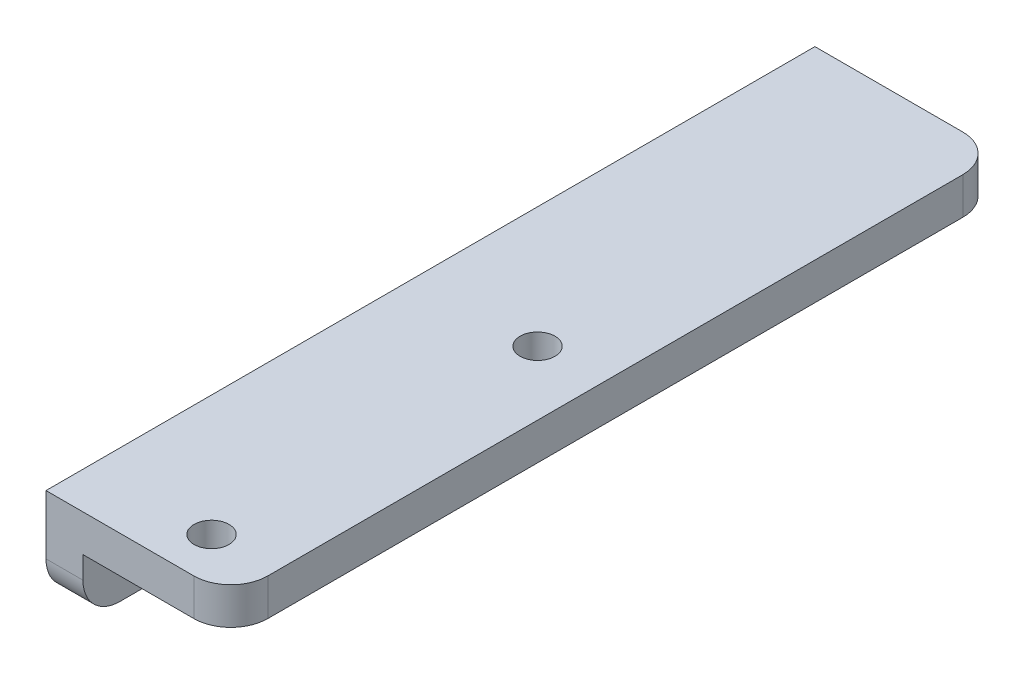
ISO-10303-21;
HEADER;
FILE_DESCRIPTION(('STEP AP214'),'2;1');
FILE_NAME('part.step','',(''),(''),'','','');
FILE_SCHEMA(('AUTOMOTIVE_DESIGN { 1 0 10303 214 1 1 1 1 }'));
ENDSEC;
DATA;
#1=APPLICATION_CONTEXT('core data for automotive mechanical design processes');
#2=APPLICATION_PROTOCOL_DEFINITION('international standard','automotive_design',2000,#1);
#3=PRODUCT_CONTEXT('',#1,'mechanical');
#4=PRODUCT('Part','Part','',(#3));
#5=PRODUCT_RELATED_PRODUCT_CATEGORY('part','',(#4));
#6=PRODUCT_DEFINITION_FORMATION('','',#4);
#7=PRODUCT_DEFINITION_CONTEXT('part definition',#1,'design');
#8=PRODUCT_DEFINITION('design','',#6,#7);
#9=PRODUCT_DEFINITION_SHAPE('','',#8);
#10=(LENGTH_UNIT() NAMED_UNIT(*) SI_UNIT(.MILLI.,.METRE.));
#11=(NAMED_UNIT(*) PLANE_ANGLE_UNIT() SI_UNIT($,.RADIAN.));
#12=(NAMED_UNIT(*) SI_UNIT($,.STERADIAN.) SOLID_ANGLE_UNIT());
#13=UNCERTAINTY_MEASURE_WITH_UNIT(LENGTH_MEASURE(1.E-05),#10,'distance_accuracy_value','');
#14=(GEOMETRIC_REPRESENTATION_CONTEXT(3) GLOBAL_UNCERTAINTY_ASSIGNED_CONTEXT((#13)) GLOBAL_UNIT_ASSIGNED_CONTEXT((#10,
#11,#12)) REPRESENTATION_CONTEXT('',''));
#15=CARTESIAN_POINT('',(0.,0.,0.));
#16=DIRECTION('',(0.,0.,1.));
#17=DIRECTION('',(1.,0.,0.));
#18=AXIS2_PLACEMENT_3D('',#15,#16,#17);
#19=CARTESIAN_POINT('',(0.,-15.875,66.04));
#20=DIRECTION('',(0.,-1.,0.));
#21=DIRECTION('',(0.,0.,1.));
#22=AXIS2_PLACEMENT_3D('',#19,#20,#21);
#23=PLANE('',#22);
#24=DIRECTION('',(0.,0.,-1.));
#25=VECTOR('',#24,1.);
#26=CARTESIAN_POINT('',(3.175,-15.875,66.04));
#27=LINE('',#26,#25);
#28=CARTESIAN_POINT('',(3.175,-15.875,17.145));
#29=VERTEX_POINT('',#28);
#30=CARTESIAN_POINT('',(3.175,-15.875,3.175));
#31=VERTEX_POINT('',#30);
#32=EDGE_CURVE('E254',#29,#31,#27,.T.);
#33=ORIENTED_EDGE('',*,*,#32,.F.);
#34=DIRECTION('',(0.,0.,1.));
#35=VECTOR('',#34,1.);
#36=CARTESIAN_POINT('',(3.175,-15.875,17.145));
#37=LINE('',#36,#35);
#38=CARTESIAN_POINT('',(3.175,-15.875,22.225));
#39=VERTEX_POINT('',#38);
#40=EDGE_CURVE('E199',#29,#39,#37,.T.);
#41=ORIENTED_EDGE('',*,*,#40,.T.);
#42=CARTESIAN_POINT('',(3.175,-15.875,37.465));
#43=VERTEX_POINT('',#42);
#44=EDGE_CURVE('E251',#43,#39,#27,.T.);
#45=ORIENTED_EDGE('',*,*,#44,.F.);
#46=DIRECTION('',(-1.,0.,0.));
#47=VECTOR('',#46,1.);
#48=CARTESIAN_POINT('',(0.,-15.875,37.465));
#49=LINE('',#48,#47);
#50=CARTESIAN_POINT('',(0.,-15.875,37.465));
#51=VERTEX_POINT('',#50);
#52=EDGE_CURVE('E288',#51,#43,#49,.F.);
#53=ORIENTED_EDGE('',*,*,#52,.F.);
#54=DIRECTION('',(0.,0.,-1.));
#55=VECTOR('',#54,1.);
#56=CARTESIAN_POINT('',(0.,-15.875,66.04));
#57=LINE('',#56,#55);
#58=CARTESIAN_POINT('',(0.,-15.875,3.175));
#59=VERTEX_POINT('',#58);
#60=EDGE_CURVE('E255',#51,#59,#57,.T.);
#61=ORIENTED_EDGE('',*,*,#60,.T.);
#62=DIRECTION('',(1.,0.,0.));
#63=VECTOR('',#62,1.);
#64=CARTESIAN_POINT('',(0.,-15.875,3.175));
#65=LINE('',#64,#63);
#66=EDGE_CURVE('E291',#31,#59,#65,.F.);
#67=ORIENTED_EDGE('',*,*,#66,.F.);
#68=EDGE_LOOP('',(#33,#41,#45,#53,#61,#67));
#69=FACE_BOUND('',#68,.T.);
#70=ADVANCED_FACE('F45',(#69),#23,.T.);
#71=CARTESIAN_POINT('',(0.,-3.175,66.04));
#72=DIRECTION('',(0.,-1.,0.));
#73=DIRECTION('',(0.,0.,1.));
#74=AXIS2_PLACEMENT_3D('',#71,#72,#73);
#75=PLANE('',#74);
#76=DIRECTION('',(0.,0.,-1.));
#77=VECTOR('',#76,1.);
#78=CARTESIAN_POINT('',(15.875,-3.175,66.04));
#79=LINE('',#78,#77);
#80=CARTESIAN_POINT('',(15.875,-3.175,17.145));
#81=VERTEX_POINT('',#80);
#82=CARTESIAN_POINT('',(15.875,-3.175,3.175));
#83=VERTEX_POINT('',#82);
#84=EDGE_CURVE('E236',#81,#83,#79,.T.);
#85=ORIENTED_EDGE('',*,*,#84,.F.);
#86=DIRECTION('',(-1.,0.,0.));
#87=VECTOR('',#86,1.);
#88=CARTESIAN_POINT('',(3.175,-3.175,17.145));
#89=LINE('',#88,#87);
#90=CARTESIAN_POINT('',(3.175,-3.175,17.145));
#91=VERTEX_POINT('',#90);
#92=EDGE_CURVE('E192',#81,#91,#89,.T.);
#93=ORIENTED_EDGE('',*,*,#92,.T.);
#94=DIRECTION('',(0.,0.,-1.));
#95=VECTOR('',#94,1.);
#96=CARTESIAN_POINT('',(3.175,-3.175,66.04));
#97=LINE('',#96,#95);
#98=CARTESIAN_POINT('',(3.175,-3.175,0.));
#99=VERTEX_POINT('',#98);
#100=EDGE_CURVE('E250',#91,#99,#97,.T.);
#101=ORIENTED_EDGE('',*,*,#100,.T.);
#102=DIRECTION('',(1.,0.,0.));
#103=VECTOR('',#102,1.);
#104=CARTESIAN_POINT('',(0.,-3.175,0.));
#105=LINE('',#104,#103);
#106=CARTESIAN_POINT('',(12.7,-3.175,0.));
#107=VERTEX_POINT('',#106);
#108=EDGE_CURVE('E215',#99,#107,#105,.T.);
#109=ORIENTED_EDGE('',*,*,#108,.T.);
#110=CARTESIAN_POINT('',(12.7,-3.175,3.175));
#111=DIRECTION('',(0.,1.,0.));
#112=DIRECTION('',(0.,0.,1.));
#113=AXIS2_PLACEMENT_3D('',#110,#111,#112);
#114=CIRCLE('',#113,3.175);
#115=EDGE_CURVE('E283',#83,#107,#114,.T.);
#116=ORIENTED_EDGE('',*,*,#115,.F.);
#117=EDGE_LOOP('',(#85,#93,#101,#109,#116));
#118=FACE_BOUND('',#117,.T.);
#119=ADVANCED_FACE('F363',(#118),#75,.T.);
#120=CARTESIAN_POINT('',(3.175,0.,66.04));
#121=DIRECTION('',(1.,0.,0.));
#122=DIRECTION('',(0.,0.,1.));
#123=AXIS2_PLACEMENT_3D('',#120,#121,#122);
#124=PLANE('',#123);
#125=CARTESIAN_POINT('',(3.175,-9.525,9.94999999999847));
#126=DIRECTION('',(-1.,0.,0.));
#127=DIRECTION('',(0.,0.,1.));
#128=AXIS2_PLACEMENT_3D('',#125,#126,#127);
#129=CIRCLE('',#128,2.49999999987849);
#130=CARTESIAN_POINT('',(3.175,-9.525,12.449999999877));
#131=VERTEX_POINT('',#130);
#132=EDGE_CURVE('E219',#131,#131,#129,.T.);
#133=ORIENTED_EDGE('',*,*,#132,.T.);
#134=EDGE_LOOP('',(#133));
#135=FACE_BOUND('',#134,.T.);
#136=DIRECTION('',(0.,1.,0.));
#137=VECTOR('',#136,1.);
#138=CARTESIAN_POINT('',(3.175,0.,0.));
#139=LINE('',#138,#137);
#140=CARTESIAN_POINT('',(3.175,-12.7,0.));
#141=VERTEX_POINT('',#140);
#142=EDGE_CURVE('E228',#141,#99,#139,.T.);
#143=ORIENTED_EDGE('',*,*,#142,.T.);
#144=ORIENTED_EDGE('',*,*,#100,.F.);
#145=DIRECTION('',(0.,-1.,0.));
#146=VECTOR('',#145,1.);
#147=CARTESIAN_POINT('',(3.175,-15.875,17.145));
#148=LINE('',#147,#146);
#149=EDGE_CURVE('E196',#91,#29,#148,.T.);
#150=ORIENTED_EDGE('',*,*,#149,.T.);
#151=ORIENTED_EDGE('',*,*,#32,.T.);
#152=CARTESIAN_POINT('',(3.175,-12.7,3.175));
#153=DIRECTION('',(-1.,0.,0.));
#154=DIRECTION('',(0.,0.,1.));
#155=AXIS2_PLACEMENT_3D('',#152,#153,#154);
#156=CIRCLE('',#155,3.175);
#157=EDGE_CURVE('E286',#141,#31,#156,.T.);
#158=ORIENTED_EDGE('',*,*,#157,.F.);
#159=EDGE_LOOP('',(#143,#144,#150,#151,#158));
#160=FACE_BOUND('',#159,.T.);
#161=ADVANCED_FACE('F366',(#135,#160),#124,.T.);
#162=CARTESIAN_POINT('',(10.375,-3.175,34.1966885776124));
#163=DIRECTION('',(0.,1.,0.));
#164=DIRECTION('',(0.,0.,1.));
#165=AXIS2_PLACEMENT_3D('',#162,#163,#164);
#166=CIRCLE('',#165,1.5);
#167=CARTESIAN_POINT('',(10.375,-3.175,35.6966885776124));
#168=VERTEX_POINT('',#167);
#169=EDGE_CURVE('E268',#168,#168,#166,.T.);
#170=ORIENTED_EDGE('',*,*,#169,.T.);
#171=EDGE_LOOP('',(#170));
#172=FACE_BOUND('',#171,.T.);
#173=CARTESIAN_POINT('',(10.375,-3.175,62.1966885776124));
#174=DIRECTION('',(0.,1.,0.));
#175=DIRECTION('',(0.,0.,1.));
#176=AXIS2_PLACEMENT_3D('',#173,#174,#175);
#177=CIRCLE('',#176,1.5);
#178=CARTESIAN_POINT('',(10.375,-3.175,63.6966885776124));
#179=VERTEX_POINT('',#178);
#180=EDGE_CURVE('E184',#179,#179,#177,.T.);
#181=ORIENTED_EDGE('',*,*,#180,.T.);
#182=EDGE_LOOP('',(#181));
#183=FACE_BOUND('',#182,.T.);
#184=DIRECTION('',(1.,0.,0.));
#185=VECTOR('',#184,1.);
#186=CARTESIAN_POINT('',(0.,-3.175,66.04));
#187=LINE('',#186,#185);
#188=CARTESIAN_POINT('',(3.175,-3.175,66.04));
#189=VERTEX_POINT('',#188);
#190=CARTESIAN_POINT('',(12.7,-3.175,66.04));
#191=VERTEX_POINT('',#190);
#192=EDGE_CURVE('E224',#189,#191,#187,.T.);
#193=ORIENTED_EDGE('',*,*,#192,.F.);
#194=CARTESIAN_POINT('',(3.175,-3.175,22.225));
#195=VERTEX_POINT('',#194);
#196=EDGE_CURVE('E246',#189,#195,#97,.T.);
#197=ORIENTED_EDGE('',*,*,#196,.T.);
#198=DIRECTION('',(-1.,0.,0.));
#199=VECTOR('',#198,1.);
#200=CARTESIAN_POINT('',(3.175,-3.175,22.225));
#201=LINE('',#200,#199);
#202=CARTESIAN_POINT('',(15.875,-3.175,22.225));
#203=VERTEX_POINT('',#202);
#204=EDGE_CURVE('E201',#203,#195,#201,.T.);
#205=ORIENTED_EDGE('',*,*,#204,.F.);
#206=CARTESIAN_POINT('',(15.875,-3.175,62.865));
#207=VERTEX_POINT('',#206);
#208=EDGE_CURVE('E264',#207,#203,#79,.T.);
#209=ORIENTED_EDGE('',*,*,#208,.F.);
#210=CARTESIAN_POINT('',(12.7,-3.175,62.865));
#211=DIRECTION('',(0.,1.,0.));
#212=DIRECTION('',(0.,0.,1.));
#213=AXIS2_PLACEMENT_3D('',#210,#211,#212);
#214=CIRCLE('',#213,3.175);
#215=EDGE_CURVE('E304',#191,#207,#214,.T.);
#216=ORIENTED_EDGE('',*,*,#215,.F.);
#217=EDGE_LOOP('',(#193,#197,#205,#209,#216));
#218=FACE_BOUND('',#217,.T.);
#219=ADVANCED_FACE('F348',(#172,#183,#218),#75,.T.);
#220=DIRECTION('',(0.,0.,1.));
#221=VECTOR('',#220,1.);
#222=CARTESIAN_POINT('',(3.175,-8.255,40.64));
#223=LINE('',#222,#221);
#224=CARTESIAN_POINT('',(3.175,-8.255,40.64));
#225=VERTEX_POINT('',#224);
#226=CARTESIAN_POINT('',(3.175,-8.255,62.865));
#227=VERTEX_POINT('',#226);
#228=EDGE_CURVE('E172',#225,#227,#223,.T.);
#229=ORIENTED_EDGE('',*,*,#228,.F.);
#230=DIRECTION('',(0.,-1.,0.));
#231=VECTOR('',#230,1.);
#232=CARTESIAN_POINT('',(3.175,-15.875,40.64));
#233=LINE('',#232,#231);
#234=CARTESIAN_POINT('',(3.175,-12.7,40.64));
#235=VERTEX_POINT('',#234);
#236=EDGE_CURVE('E162',#225,#235,#233,.T.);
#237=ORIENTED_EDGE('',*,*,#236,.T.);
#238=CARTESIAN_POINT('',(3.175,-12.7,37.465));
#239=DIRECTION('',(-1.,0.,0.));
#240=DIRECTION('',(0.,0.,1.));
#241=AXIS2_PLACEMENT_3D('',#238,#239,#240);
#242=CIRCLE('',#241,3.175);
#243=EDGE_CURVE('E308',#43,#235,#242,.T.);
#244=ORIENTED_EDGE('',*,*,#243,.F.);
#245=ORIENTED_EDGE('',*,*,#44,.T.);
#246=DIRECTION('',(0.,-1.,0.));
#247=VECTOR('',#246,1.);
#248=CARTESIAN_POINT('',(3.175,-15.875,22.225));
#249=LINE('',#248,#247);
#250=EDGE_CURVE('E193',#195,#39,#249,.T.);
#251=ORIENTED_EDGE('',*,*,#250,.F.);
#252=ORIENTED_EDGE('',*,*,#196,.F.);
#253=DIRECTION('',(0.,1.,0.));
#254=VECTOR('',#253,1.);
#255=CARTESIAN_POINT('',(3.175,0.,66.04));
#256=LINE('',#255,#254);
#257=CARTESIAN_POINT('',(3.175,-5.08,66.04));
#258=VERTEX_POINT('',#257);
#259=EDGE_CURVE('E234',#258,#189,#256,.T.);
#260=ORIENTED_EDGE('',*,*,#259,.F.);
#261=CARTESIAN_POINT('',(3.175,-5.08,62.865));
#262=DIRECTION('',(-1.,0.,0.));
#263=DIRECTION('',(0.,0.,1.));
#264=AXIS2_PLACEMENT_3D('',#261,#262,#263);
#265=CIRCLE('',#264,3.175);
#266=EDGE_CURVE('E53',#227,#258,#265,.T.);
#267=ORIENTED_EDGE('',*,*,#266,.F.);
#268=EDGE_LOOP('',(#229,#237,#244,#245,#251,#252,#260,#267));
#269=FACE_BOUND('',#268,.T.);
#270=CARTESIAN_POINT('',(3.175,-9.52499999999992,29.9499999999985));
#271=DIRECTION('',(-1.,0.,0.));
#272=DIRECTION('',(0.,0.,1.));
#273=AXIS2_PLACEMENT_3D('',#270,#271,#272);
#274=CIRCLE('',#273,2.49999999987849);
#275=CARTESIAN_POINT('',(3.175,-9.52499999999992,32.449999999877));
#276=VERTEX_POINT('',#275);
#277=EDGE_CURVE('E216',#276,#276,#274,.T.);
#278=ORIENTED_EDGE('',*,*,#277,.T.);
#279=EDGE_LOOP('',(#278));
#280=FACE_BOUND('',#279,.T.);
#281=ADVANCED_FACE('F313',(#269,#280),#124,.T.);
#282=CARTESIAN_POINT('',(0.,0.,66.04));
#283=DIRECTION('',(-1.,0.,0.));
#284=DIRECTION('',(0.,-1.,0.));
#285=AXIS2_PLACEMENT_3D('',#282,#283,#284);
#286=PLANE('',#285);
#287=ORIENTED_EDGE('',*,*,#60,.F.);
#288=CARTESIAN_POINT('',(0.,-12.7,37.465));
#289=DIRECTION('',(1.,0.,0.));
#290=DIRECTION('',(0.,-1.,0.));
#291=AXIS2_PLACEMENT_3D('',#288,#289,#290);
#292=CIRCLE('',#291,3.175);
#293=CARTESIAN_POINT('',(0.,-12.7,40.64));
#294=VERTEX_POINT('',#293);
#295=EDGE_CURVE('E177',#294,#51,#292,.T.);
#296=ORIENTED_EDGE('',*,*,#295,.F.);
#297=DIRECTION('',(0.,1.,0.));
#298=VECTOR('',#297,1.);
#299=CARTESIAN_POINT('',(0.,-15.875,40.64));
#300=LINE('',#299,#298);
#301=CARTESIAN_POINT('',(0.,-8.255,40.64));
#302=VERTEX_POINT('',#301);
#303=EDGE_CURVE('E159',#294,#302,#300,.T.);
#304=ORIENTED_EDGE('',*,*,#303,.T.);
#305=DIRECTION('',(0.,0.,1.));
#306=VECTOR('',#305,1.);
#307=CARTESIAN_POINT('',(0.,-8.255,40.64));
#308=LINE('',#307,#306);
#309=CARTESIAN_POINT('',(0.,-8.255,62.865));
#310=VERTEX_POINT('',#309);
#311=EDGE_CURVE('E168',#302,#310,#308,.T.);
#312=ORIENTED_EDGE('',*,*,#311,.T.);
#313=CARTESIAN_POINT('',(0.,-5.08,62.865));
#314=DIRECTION('',(1.,0.,0.));
#315=DIRECTION('',(0.,-1.,0.));
#316=AXIS2_PLACEMENT_3D('',#313,#314,#315);
#317=CIRCLE('',#316,3.175);
#318=CARTESIAN_POINT('',(0.,-5.08,66.04));
#319=VERTEX_POINT('',#318);
#320=EDGE_CURVE('E295',#319,#310,#317,.T.);
#321=ORIENTED_EDGE('',*,*,#320,.F.);
#322=DIRECTION('',(0.,-1.,0.));
#323=VECTOR('',#322,1.);
#324=CARTESIAN_POINT('',(0.,0.,66.04));
#325=LINE('',#324,#323);
#326=CARTESIAN_POINT('',(0.,0.,66.04));
#327=VERTEX_POINT('',#326);
#328=EDGE_CURVE('E231',#327,#319,#325,.T.);
#329=ORIENTED_EDGE('',*,*,#328,.F.);
#330=DIRECTION('',(0.,0.,-1.));
#331=VECTOR('',#330,1.);
#332=CARTESIAN_POINT('',(0.,0.,66.04));
#333=LINE('',#332,#331);
#334=CARTESIAN_POINT('',(0.,0.,0.));
#335=VERTEX_POINT('',#334);
#336=EDGE_CURVE('E258',#327,#335,#333,.T.);
#337=ORIENTED_EDGE('',*,*,#336,.T.);
#338=DIRECTION('',(0.,-1.,0.));
#339=VECTOR('',#338,1.);
#340=CARTESIAN_POINT('',(0.,0.,0.));
#341=LINE('',#340,#339);
#342=CARTESIAN_POINT('',(0.,-12.7,0.));
#343=VERTEX_POINT('',#342);
#344=EDGE_CURVE('E242',#335,#343,#341,.T.);
#345=ORIENTED_EDGE('',*,*,#344,.T.);
#346=CARTESIAN_POINT('',(0.,-12.7,3.175));
#347=DIRECTION('',(1.,0.,0.));
#348=DIRECTION('',(0.,-1.,0.));
#349=AXIS2_PLACEMENT_3D('',#346,#347,#348);
#350=CIRCLE('',#349,3.175);
#351=EDGE_CURVE('E297',#59,#343,#350,.T.);
#352=ORIENTED_EDGE('',*,*,#351,.F.);
#353=EDGE_LOOP('',(#287,#296,#304,#312,#321,#329,#337,#345,#352));
#354=FACE_BOUND('',#353,.T.);
#355=CARTESIAN_POINT('',(0.,-9.52499999999992,29.9499999999985));
#356=DIRECTION('',(-1.,0.,0.));
#357=DIRECTION('',(0.,0.,1.));
#358=AXIS2_PLACEMENT_3D('',#355,#356,#357);
#359=CIRCLE('',#358,2.49999999987849);
#360=CARTESIAN_POINT('',(0.,-9.52499999999992,32.449999999877));
#361=VERTEX_POINT('',#360);
#362=EDGE_CURVE('E212',#361,#361,#359,.T.);
#363=ORIENTED_EDGE('',*,*,#362,.F.);
#364=EDGE_LOOP('',(#363));
#365=FACE_BOUND('',#364,.T.);
#366=CARTESIAN_POINT('',(0.,-9.525,9.94999999999847));
#367=DIRECTION('',(-1.,0.,0.));
#368=DIRECTION('',(0.,0.,1.));
#369=AXIS2_PLACEMENT_3D('',#366,#367,#368);
#370=CIRCLE('',#369,2.49999999987849);
#371=CARTESIAN_POINT('',(0.,-9.525,12.449999999877));
#372=VERTEX_POINT('',#371);
#373=EDGE_CURVE('E211',#372,#372,#370,.T.);
#374=ORIENTED_EDGE('',*,*,#373,.F.);
#375=EDGE_LOOP('',(#374));
#376=FACE_BOUND('',#375,.T.);
#377=ADVANCED_FACE('F175',(#354,#365,#376),#286,.T.);
#378=CARTESIAN_POINT('',(0.,0.,66.04));
#379=DIRECTION('',(0.,-1.,0.));
#380=DIRECTION('',(0.,0.,1.));
#381=AXIS2_PLACEMENT_3D('',#378,#379,#380);
#382=PLANE('',#381);
#383=CARTESIAN_POINT('',(10.375,0.,34.1966885776124));
#384=DIRECTION('',(0.,1.,0.));
#385=DIRECTION('',(0.,0.,1.));
#386=AXIS2_PLACEMENT_3D('',#383,#384,#385);
#387=CIRCLE('',#386,1.5);
#388=CARTESIAN_POINT('',(10.375,0.,35.6966885776124));
#389=VERTEX_POINT('',#388);
#390=EDGE_CURVE('E178',#389,#389,#387,.T.);
#391=ORIENTED_EDGE('',*,*,#390,.F.);
#392=EDGE_LOOP('',(#391));
#393=FACE_BOUND('',#392,.T.);
#394=CARTESIAN_POINT('',(10.375,0.,62.1966885776124));
#395=DIRECTION('',(0.,1.,0.));
#396=DIRECTION('',(0.,0.,1.));
#397=AXIS2_PLACEMENT_3D('',#394,#395,#396);
#398=CIRCLE('',#397,1.5);
#399=CARTESIAN_POINT('',(10.375,0.,63.6966885776124));
#400=VERTEX_POINT('',#399);
#401=EDGE_CURVE('E181',#400,#400,#398,.T.);
#402=ORIENTED_EDGE('',*,*,#401,.F.);
#403=EDGE_LOOP('',(#402));
#404=FACE_BOUND('',#403,.T.);
#405=DIRECTION('',(1.,0.,0.));
#406=VECTOR('',#405,1.);
#407=CARTESIAN_POINT('',(0.,0.,0.));
#408=LINE('',#407,#406);
#409=CARTESIAN_POINT('',(12.7,0.,0.));
#410=VERTEX_POINT('',#409);
#411=EDGE_CURVE('E239',#335,#410,#408,.T.);
#412=ORIENTED_EDGE('',*,*,#411,.F.);
#413=ORIENTED_EDGE('',*,*,#336,.F.);
#414=DIRECTION('',(1.,0.,0.));
#415=VECTOR('',#414,1.);
#416=CARTESIAN_POINT('',(0.,0.,66.04));
#417=LINE('',#416,#415);
#418=CARTESIAN_POINT('',(12.7,0.,66.04));
#419=VERTEX_POINT('',#418);
#420=EDGE_CURVE('E227',#327,#419,#417,.T.);
#421=ORIENTED_EDGE('',*,*,#420,.T.);
#422=CARTESIAN_POINT('',(12.7,0.,62.865));
#423=DIRECTION('',(0.,1.,0.));
#424=DIRECTION('',(0.,0.,1.));
#425=AXIS2_PLACEMENT_3D('',#422,#423,#424);
#426=CIRCLE('',#425,3.175);
#427=CARTESIAN_POINT('',(15.875,0.,62.865));
#428=VERTEX_POINT('',#427);
#429=EDGE_CURVE('E273',#428,#419,#426,.F.);
#430=ORIENTED_EDGE('',*,*,#429,.F.);
#431=DIRECTION('',(0.,0.,-1.));
#432=VECTOR('',#431,1.);
#433=CARTESIAN_POINT('',(15.875,0.,66.04));
#434=LINE('',#433,#432);
#435=CARTESIAN_POINT('',(15.875,0.,3.175));
#436=VERTEX_POINT('',#435);
#437=EDGE_CURVE('E261',#428,#436,#434,.T.);
#438=ORIENTED_EDGE('',*,*,#437,.T.);
#439=CARTESIAN_POINT('',(12.7,0.,3.175));
#440=DIRECTION('',(0.,1.,0.));
#441=DIRECTION('',(0.,0.,1.));
#442=AXIS2_PLACEMENT_3D('',#439,#440,#441);
#443=CIRCLE('',#442,3.175);
#444=EDGE_CURVE('E276',#410,#436,#443,.F.);
#445=ORIENTED_EDGE('',*,*,#444,.F.);
#446=EDGE_LOOP('',(#412,#413,#421,#430,#438,#445));
#447=FACE_BOUND('',#446,.T.);
#448=ADVANCED_FACE('F322',(#393,#404,#447),#382,.F.);
#449=CARTESIAN_POINT('',(15.875,0.,66.04));
#450=DIRECTION('',(1.,0.,0.));
#451=DIRECTION('',(0.,0.,1.));
#452=AXIS2_PLACEMENT_3D('',#449,#450,#451);
#453=PLANE('',#452);
#454=ORIENTED_EDGE('',*,*,#437,.F.);
#455=DIRECTION('',(0.,1.,0.));
#456=VECTOR('',#455,1.);
#457=CARTESIAN_POINT('',(15.875,0.,62.865));
#458=LINE('',#457,#456);
#459=EDGE_CURVE('E279',#207,#428,#458,.T.);
#460=ORIENTED_EDGE('',*,*,#459,.F.);
#461=ORIENTED_EDGE('',*,*,#208,.T.);
#462=DIRECTION('',(0.,0.,1.));
#463=VECTOR('',#462,1.);
#464=CARTESIAN_POINT('',(15.875,-3.175,17.145));
#465=LINE('',#464,#463);
#466=EDGE_CURVE('E208',#81,#203,#465,.T.);
#467=ORIENTED_EDGE('',*,*,#466,.F.);
#468=ORIENTED_EDGE('',*,*,#84,.T.);
#469=DIRECTION('',(0.,1.,0.));
#470=VECTOR('',#469,1.);
#471=CARTESIAN_POINT('',(15.875,0.,3.175));
#472=LINE('',#471,#470);
#473=EDGE_CURVE('E281',#436,#83,#472,.F.);
#474=ORIENTED_EDGE('',*,*,#473,.F.);
#475=EDGE_LOOP('',(#454,#460,#461,#467,#468,#474));
#476=FACE_BOUND('',#475,.T.);
#477=ADVANCED_FACE('F354',(#476),#453,.T.);
#478=CARTESIAN_POINT('',(0.,0.,66.04));
#479=DIRECTION('',(0.,0.,-1.));
#480=DIRECTION('',(1.,0.,0.));
#481=AXIS2_PLACEMENT_3D('',#478,#479,#480);
#482=PLANE('',#481);
#483=ORIENTED_EDGE('',*,*,#420,.F.);
#484=ORIENTED_EDGE('',*,*,#328,.T.);
#485=DIRECTION('',(1.,0.,0.));
#486=VECTOR('',#485,1.);
#487=CARTESIAN_POINT('',(0.,-5.08,66.04));
#488=LINE('',#487,#486);
#489=EDGE_CURVE('E300',#258,#319,#488,.F.);
#490=ORIENTED_EDGE('',*,*,#489,.F.);
#491=ORIENTED_EDGE('',*,*,#259,.T.);
#492=ORIENTED_EDGE('',*,*,#192,.T.);
#493=DIRECTION('',(0.,1.,0.));
#494=VECTOR('',#493,1.);
#495=CARTESIAN_POINT('',(12.7,-3.175,66.04));
#496=LINE('',#495,#494);
#497=EDGE_CURVE('E302',#419,#191,#496,.F.);
#498=ORIENTED_EDGE('',*,*,#497,.F.);
#499=EDGE_LOOP('',(#483,#484,#490,#491,#492,#498));
#500=FACE_BOUND('',#499,.T.);
#501=ADVANCED_FACE('F317',(#500),#482,.F.);
#502=CARTESIAN_POINT('',(0.,0.,0.));
#503=DIRECTION('',(0.,0.,-1.));
#504=DIRECTION('',(1.,0.,0.));
#505=AXIS2_PLACEMENT_3D('',#502,#503,#504);
#506=PLANE('',#505);
#507=ORIENTED_EDGE('',*,*,#108,.F.);
#508=ORIENTED_EDGE('',*,*,#142,.F.);
#509=DIRECTION('',(1.,0.,0.));
#510=VECTOR('',#509,1.);
#511=CARTESIAN_POINT('',(0.,-12.7,0.));
#512=LINE('',#511,#510);
#513=EDGE_CURVE('E249',#343,#141,#512,.T.);
#514=ORIENTED_EDGE('',*,*,#513,.F.);
#515=ORIENTED_EDGE('',*,*,#344,.F.);
#516=ORIENTED_EDGE('',*,*,#411,.T.);
#517=DIRECTION('',(0.,1.,0.));
#518=VECTOR('',#517,1.);
#519=CARTESIAN_POINT('',(12.7,0.,0.));
#520=LINE('',#519,#518);
#521=EDGE_CURVE('E271',#107,#410,#520,.T.);
#522=ORIENTED_EDGE('',*,*,#521,.F.);
#523=EDGE_LOOP('',(#507,#508,#514,#515,#516,#522));
#524=FACE_BOUND('',#523,.T.);
#525=ADVANCED_FACE('F327',(#524),#506,.T.);
#526=CARTESIAN_POINT('',(0.,-9.525,9.94999999999847));
#527=DIRECTION('',(1.,0.,0.));
#528=DIRECTION('',(0.,0.,1.));
#529=AXIS2_PLACEMENT_3D('',#526,#527,#528);
#530=CYLINDRICAL_SURFACE('',#529,2.49999999987849);
#531=ORIENTED_EDGE('',*,*,#373,.T.);
#532=EDGE_LOOP('',(#531));
#533=FACE_BOUND('',#532,.T.);
#534=ORIENTED_EDGE('',*,*,#132,.F.);
#535=EDGE_LOOP('',(#534));
#536=FACE_BOUND('',#535,.T.);
#537=ADVANCED_FACE('F495',(#533,#536),#530,.F.);
#538=CARTESIAN_POINT('',(0.,-9.52499999999992,29.9499999999985));
#539=DIRECTION('',(1.,0.,0.));
#540=DIRECTION('',(0.,0.,1.));
#541=AXIS2_PLACEMENT_3D('',#538,#539,#540);
#542=CYLINDRICAL_SURFACE('',#541,2.49999999987849);
#543=ORIENTED_EDGE('',*,*,#362,.T.);
#544=EDGE_LOOP('',(#543));
#545=FACE_BOUND('',#544,.T.);
#546=ORIENTED_EDGE('',*,*,#277,.F.);
#547=EDGE_LOOP('',(#546));
#548=FACE_BOUND('',#547,.T.);
#549=ADVANCED_FACE('F376',(#545,#548),#542,.F.);
#550=CARTESIAN_POINT('',(3.175,-15.875,17.145));
#551=DIRECTION('',(-0.707106781186548,0.707106781186548,0.));
#552=DIRECTION('',(-0.707106781186548,-0.707106781186548,0.));
#553=AXIS2_PLACEMENT_3D('',#550,#551,#552);
#554=PLANE('',#553);
#555=DIRECTION('',(0.707106781186547,0.707106781186547,0.));
#556=VECTOR('',#555,1.);
#557=CARTESIAN_POINT('',(3.175,-15.875,22.225));
#558=LINE('',#557,#556);
#559=EDGE_CURVE('E188',#39,#203,#558,.T.);
#560=ORIENTED_EDGE('',*,*,#559,.F.);
#561=ORIENTED_EDGE('',*,*,#40,.F.);
#562=DIRECTION('',(0.707106781186547,0.707106781186547,0.));
#563=VECTOR('',#562,1.);
#564=CARTESIAN_POINT('',(3.175,-15.875,17.145));
#565=LINE('',#564,#563);
#566=EDGE_CURVE('E190',#29,#81,#565,.T.);
#567=ORIENTED_EDGE('',*,*,#566,.T.);
#568=ORIENTED_EDGE('',*,*,#466,.T.);
#569=EDGE_LOOP('',(#560,#561,#567,#568));
#570=FACE_BOUND('',#569,.T.);
#571=ADVANCED_FACE('F341',(#570),#554,.F.);
#572=CARTESIAN_POINT('',(0.,0.,17.145));
#573=DIRECTION('',(0.,0.,1.));
#574=DIRECTION('',(-1.,0.,0.));
#575=AXIS2_PLACEMENT_3D('',#572,#573,#574);
#576=PLANE('',#575);
#577=ORIENTED_EDGE('',*,*,#566,.F.);
#578=ORIENTED_EDGE('',*,*,#149,.F.);
#579=ORIENTED_EDGE('',*,*,#92,.F.);
#580=EDGE_LOOP('',(#577,#578,#579));
#581=FACE_BOUND('',#580,.T.);
#582=ADVANCED_FACE('F368',(#581),#576,.F.);
#583=CARTESIAN_POINT('',(0.,0.,22.225));
#584=DIRECTION('',(0.,0.,1.));
#585=DIRECTION('',(-1.,0.,0.));
#586=AXIS2_PLACEMENT_3D('',#583,#584,#585);
#587=PLANE('',#586);
#588=ORIENTED_EDGE('',*,*,#559,.T.);
#589=ORIENTED_EDGE('',*,*,#204,.T.);
#590=ORIENTED_EDGE('',*,*,#250,.T.);
#591=EDGE_LOOP('',(#588,#589,#590));
#592=FACE_BOUND('',#591,.T.);
#593=ADVANCED_FACE('F344',(#592),#587,.T.);
#594=CARTESIAN_POINT('',(0.,-8.255,40.64));
#595=DIRECTION('',(0.,1.,0.));
#596=DIRECTION('',(0.,0.,-1.));
#597=AXIS2_PLACEMENT_3D('',#594,#595,#596);
#598=PLANE('',#597);
#599=ORIENTED_EDGE('',*,*,#311,.F.);
#600=DIRECTION('',(1.,0.,0.));
#601=VECTOR('',#600,1.);
#602=CARTESIAN_POINT('',(0.,-8.255,40.64));
#603=LINE('',#602,#601);
#604=EDGE_CURVE('E155',#302,#225,#603,.T.);
#605=ORIENTED_EDGE('',*,*,#604,.T.);
#606=ORIENTED_EDGE('',*,*,#228,.T.);
#607=DIRECTION('',(1.,0.,0.));
#608=VECTOR('',#607,1.);
#609=CARTESIAN_POINT('',(0.,-8.255,62.865));
#610=LINE('',#609,#608);
#611=EDGE_CURVE('E66',#310,#227,#610,.T.);
#612=ORIENTED_EDGE('',*,*,#611,.F.);
#613=EDGE_LOOP('',(#599,#605,#606,#612));
#614=FACE_BOUND('',#613,.T.);
#615=ADVANCED_FACE('F169',(#614),#598,.F.);
#616=CARTESIAN_POINT('',(0.,0.,40.64));
#617=DIRECTION('',(0.,0.,1.));
#618=DIRECTION('',(-1.,0.,0.));
#619=AXIS2_PLACEMENT_3D('',#616,#617,#618);
#620=PLANE('',#619);
#621=ORIENTED_EDGE('',*,*,#236,.F.);
#622=ORIENTED_EDGE('',*,*,#604,.F.);
#623=ORIENTED_EDGE('',*,*,#303,.F.);
#624=DIRECTION('',(-1.,0.,0.));
#625=VECTOR('',#624,1.);
#626=CARTESIAN_POINT('',(0.,-12.7,40.64));
#627=LINE('',#626,#625);
#628=EDGE_CURVE('E11',#235,#294,#627,.T.);
#629=ORIENTED_EDGE('',*,*,#628,.F.);
#630=EDGE_LOOP('',(#621,#622,#623,#629));
#631=FACE_BOUND('',#630,.T.);
#632=ADVANCED_FACE('F157',(#631),#620,.T.);
#633=CARTESIAN_POINT('',(10.375,22.225,62.1966885776124));
#634=DIRECTION('',(0.,-1.,0.));
#635=DIRECTION('',(0.,0.,1.));
#636=AXIS2_PLACEMENT_3D('',#633,#634,#635);
#637=CYLINDRICAL_SURFACE('',#636,1.5);
#638=CARTESIAN_POINT('',(10.375,-3.175,63.6966885776124));
#639=CARTESIAN_POINT('',(10.375,-3.14192708333333,63.6966885776124));
#640=CARTESIAN_POINT('',(10.375,-3.10885416666667,63.6966885776124));
#641=CARTESIAN_POINT('',(10.375,-3.04270833333333,63.6966885776124));
#642=CARTESIAN_POINT('',(10.375,-3.00963541666667,63.6966885776124));
#643=CARTESIAN_POINT('',(10.375,-2.94348958333333,63.6966885776124));
#644=CARTESIAN_POINT('',(10.375,-2.91041666666667,63.6966885776124));
#645=CARTESIAN_POINT('',(10.375,-2.84427083333333,63.6966885776124));
#646=CARTESIAN_POINT('',(10.375,-2.81119791666667,63.6966885776124));
#647=CARTESIAN_POINT('',(10.375,-2.74505208333334,63.6966885776124));
#648=CARTESIAN_POINT('',(10.375,-2.71197916666667,63.6966885776124));
#649=CARTESIAN_POINT('',(10.375,-2.64583333333333,63.6966885776124));
#650=CARTESIAN_POINT('',(10.375,-2.61276041666667,63.6966885776124));
#651=CARTESIAN_POINT('',(10.375,-2.54661458333333,63.6966885776124));
#652=CARTESIAN_POINT('',(10.375,-2.51354166666667,63.6966885776124));
#653=CARTESIAN_POINT('',(10.375,-2.44739583333334,63.6966885776124));
#654=CARTESIAN_POINT('',(10.375,-2.41432291666667,63.6966885776124));
#655=CARTESIAN_POINT('',(10.375,-2.34817708333333,63.6966885776124));
#656=CARTESIAN_POINT('',(10.375,-2.31510416666667,63.6966885776124));
#657=CARTESIAN_POINT('',(10.375,-2.24895833333333,63.6966885776124));
#658=CARTESIAN_POINT('',(10.375,-2.21588541666667,63.6966885776124));
#659=CARTESIAN_POINT('',(10.375,-2.14973958333334,63.6966885776124));
#660=CARTESIAN_POINT('',(10.375,-2.11666666666667,63.6966885776124));
#661=CARTESIAN_POINT('',(10.375,-2.05052083333333,63.6966885776124));
#662=CARTESIAN_POINT('',(10.375,-2.01744791666667,63.6966885776124));
#663=CARTESIAN_POINT('',(10.375,-1.95130208333333,63.6966885776124));
#664=CARTESIAN_POINT('',(10.375,-1.91822916666667,63.6966885776124));
#665=CARTESIAN_POINT('',(10.375,-1.85208333333334,63.6966885776124));
#666=CARTESIAN_POINT('',(10.375,-1.81901041666667,63.6966885776124));
#667=CARTESIAN_POINT('',(10.375,-1.75286458333334,63.6966885776124));
#668=CARTESIAN_POINT('',(10.375,-1.71979166666667,63.6966885776124));
#669=CARTESIAN_POINT('',(10.375,-1.65364583333334,63.6966885776124));
#670=CARTESIAN_POINT('',(10.375,-1.62057291666667,63.6966885776124));
#671=CARTESIAN_POINT('',(10.375,-1.55442708333333,63.6966885776124));
#672=CARTESIAN_POINT('',(10.375,-1.52135416666667,63.6966885776124));
#673=CARTESIAN_POINT('',(10.375,-1.45520833333333,63.6966885776124));
#674=CARTESIAN_POINT('',(10.375,-1.42213541666667,63.6966885776124));
#675=CARTESIAN_POINT('',(10.375,-1.35598958333334,63.6966885776124));
#676=CARTESIAN_POINT('',(10.375,-1.32291666666667,63.6966885776124));
#677=CARTESIAN_POINT('',(10.375,-1.25677083333334,63.6966885776124));
#678=CARTESIAN_POINT('',(10.375,-1.22369791666667,63.6966885776124));
#679=CARTESIAN_POINT('',(10.375,-1.15755208333334,63.6966885776124));
#680=CARTESIAN_POINT('',(10.375,-1.12447916666667,63.6966885776124));
#681=CARTESIAN_POINT('',(10.375,-1.05833333333334,63.6966885776124));
#682=CARTESIAN_POINT('',(10.375,-1.02526041666667,63.6966885776124));
#683=CARTESIAN_POINT('',(10.375,-0.959114583333336,63.6966885776124));
#684=CARTESIAN_POINT('',(10.375,-0.92604166666667,63.6966885776124));
#685=CARTESIAN_POINT('',(10.375,-0.859895833333337,63.6966885776124));
#686=CARTESIAN_POINT('',(10.375,-0.82682291666667,63.6966885776124));
#687=CARTESIAN_POINT('',(10.375,-0.760677083333336,63.6966885776124));
#688=CARTESIAN_POINT('',(10.375,-0.727604166666669,63.6966885776124));
#689=CARTESIAN_POINT('',(10.375,-0.661458333333336,63.6966885776124));
#690=CARTESIAN_POINT('',(10.375,-0.62838541666667,63.6966885776124));
#691=CARTESIAN_POINT('',(10.375,-0.562239583333337,63.6966885776124));
#692=CARTESIAN_POINT('',(10.375,-0.52916666666667,63.6966885776124));
#693=CARTESIAN_POINT('',(10.375,-0.463020833333336,63.6966885776124));
#694=CARTESIAN_POINT('',(10.375,-0.429947916666668,63.6966885776124));
#695=CARTESIAN_POINT('',(10.375,-0.363802083333335,63.6966885776124));
#696=CARTESIAN_POINT('',(10.375,-0.33072916666667,63.6966885776124));
#697=CARTESIAN_POINT('',(10.375,-0.264583333333337,63.6966885776124));
#698=CARTESIAN_POINT('',(10.375,-0.231510416666669,63.6966885776124));
#699=CARTESIAN_POINT('',(10.375,-0.165364583333337,63.6966885776124));
#700=CARTESIAN_POINT('',(10.375,-0.132291666666671,63.6966885776124));
#701=CARTESIAN_POINT('',(10.375,-0.0661458333333376,63.6966885776124));
#702=CARTESIAN_POINT('',(10.375,-0.0330729166666706,63.6966885776124));
#703=CARTESIAN_POINT('',(10.375,0.,63.6966885776124));
#704=B_SPLINE_CURVE_WITH_KNOTS('',3,(#638,#639,#640,#641,#642,#643,#644,#645,#646,#647,#648,
#649,#650,#651,#652,#653,#654,#655,#656,#657,#658,#659,#660,#661,#662,#663,#664,#665,#666,#667,
#668,#669,#670,#671,#672,#673,#674,#675,#676,#677,#678,#679,#680,#681,#682,#683,#684,#685,#686,
#687,#688,#689,#690,#691,#692,#693,#694,#695,#696,#697,#698,#699,#700,#701,#702,#703),
.UNSPECIFIED.,.F.,.F.,(4,2,2,2,2,2,2,2,2,2,2,2,2,2,2,2,2,2,2,2,2,2,2,2,2,2,2,2,2,2,2,2,4),(0.,
0.0992187500000012,0.198437499999999,0.29765625,0.396874999999998,0.496093749999999,0.5953125,
0.694531249999998,0.793749999999999,0.892968750000001,0.992187499999998,1.09140625,1.190625,
1.28984375,1.3890625,1.48828125,1.5875,1.68671875,1.7859375,1.88515625,1.984375,2.08359375,
2.1828125,2.28203125,2.38125,2.48046875,2.5796875,2.67890625,2.778125,2.87734375,2.9765625,
3.07578125,3.175),.UNSPECIFIED.);
#705=EDGE_CURVE('BSEAM444',#179,#400,#704,.T.);
#706=ORIENTED_EDGE('',*,*,#180,.F.);
#707=ORIENTED_EDGE('',*,*,#401,.T.);
#708=ORIENTED_EDGE('',*,*,#705,.T.);
#709=ORIENTED_EDGE('',*,*,#705,.F.);
#710=EDGE_LOOP('',(#706,#708,#707,#709));
#711=FACE_BOUND('',#710,.T.);
#712=ADVANCED_FACE('F444',(#711),#637,.F.);
#713=CARTESIAN_POINT('',(10.375,22.225,34.1966885776124));
#714=DIRECTION('',(0.,-1.,0.));
#715=DIRECTION('',(0.,0.,1.));
#716=AXIS2_PLACEMENT_3D('',#713,#714,#715);
#717=CYLINDRICAL_SURFACE('',#716,1.5);
#718=CARTESIAN_POINT('',(10.375,-3.175,35.6966885776124));
#719=CARTESIAN_POINT('',(10.375,-3.14192708333333,35.6966885776124));
#720=CARTESIAN_POINT('',(10.375,-3.10885416666667,35.6966885776124));
#721=CARTESIAN_POINT('',(10.375,-3.04270833333333,35.6966885776124));
#722=CARTESIAN_POINT('',(10.375,-3.00963541666667,35.6966885776124));
#723=CARTESIAN_POINT('',(10.375,-2.94348958333333,35.6966885776124));
#724=CARTESIAN_POINT('',(10.375,-2.91041666666667,35.6966885776124));
#725=CARTESIAN_POINT('',(10.375,-2.84427083333333,35.6966885776124));
#726=CARTESIAN_POINT('',(10.375,-2.81119791666667,35.6966885776124));
#727=CARTESIAN_POINT('',(10.375,-2.74505208333334,35.6966885776124));
#728=CARTESIAN_POINT('',(10.375,-2.71197916666667,35.6966885776124));
#729=CARTESIAN_POINT('',(10.375,-2.64583333333333,35.6966885776124));
#730=CARTESIAN_POINT('',(10.375,-2.61276041666667,35.6966885776124));
#731=CARTESIAN_POINT('',(10.375,-2.54661458333333,35.6966885776124));
#732=CARTESIAN_POINT('',(10.375,-2.51354166666667,35.6966885776124));
#733=CARTESIAN_POINT('',(10.375,-2.44739583333334,35.6966885776124));
#734=CARTESIAN_POINT('',(10.375,-2.41432291666667,35.6966885776124));
#735=CARTESIAN_POINT('',(10.375,-2.34817708333333,35.6966885776124));
#736=CARTESIAN_POINT('',(10.375,-2.31510416666667,35.6966885776124));
#737=CARTESIAN_POINT('',(10.375,-2.24895833333333,35.6966885776124));
#738=CARTESIAN_POINT('',(10.375,-2.21588541666667,35.6966885776124));
#739=CARTESIAN_POINT('',(10.375,-2.14973958333334,35.6966885776124));
#740=CARTESIAN_POINT('',(10.375,-2.11666666666667,35.6966885776124));
#741=CARTESIAN_POINT('',(10.375,-2.05052083333333,35.6966885776124));
#742=CARTESIAN_POINT('',(10.375,-2.01744791666667,35.6966885776124));
#743=CARTESIAN_POINT('',(10.375,-1.95130208333333,35.6966885776124));
#744=CARTESIAN_POINT('',(10.375,-1.91822916666667,35.6966885776124));
#745=CARTESIAN_POINT('',(10.375,-1.85208333333334,35.6966885776124));
#746=CARTESIAN_POINT('',(10.375,-1.81901041666667,35.6966885776124));
#747=CARTESIAN_POINT('',(10.375,-1.75286458333334,35.6966885776124));
#748=CARTESIAN_POINT('',(10.375,-1.71979166666667,35.6966885776124));
#749=CARTESIAN_POINT('',(10.375,-1.65364583333334,35.6966885776124));
#750=CARTESIAN_POINT('',(10.375,-1.62057291666667,35.6966885776124));
#751=CARTESIAN_POINT('',(10.375,-1.55442708333333,35.6966885776124));
#752=CARTESIAN_POINT('',(10.375,-1.52135416666667,35.6966885776124));
#753=CARTESIAN_POINT('',(10.375,-1.45520833333333,35.6966885776124));
#754=CARTESIAN_POINT('',(10.375,-1.42213541666667,35.6966885776124));
#755=CARTESIAN_POINT('',(10.375,-1.35598958333334,35.6966885776124));
#756=CARTESIAN_POINT('',(10.375,-1.32291666666667,35.6966885776124));
#757=CARTESIAN_POINT('',(10.375,-1.25677083333334,35.6966885776124));
#758=CARTESIAN_POINT('',(10.375,-1.22369791666667,35.6966885776124));
#759=CARTESIAN_POINT('',(10.375,-1.15755208333334,35.6966885776124));
#760=CARTESIAN_POINT('',(10.375,-1.12447916666667,35.6966885776124));
#761=CARTESIAN_POINT('',(10.375,-1.05833333333334,35.6966885776124));
#762=CARTESIAN_POINT('',(10.375,-1.02526041666667,35.6966885776124));
#763=CARTESIAN_POINT('',(10.375,-0.959114583333336,35.6966885776124));
#764=CARTESIAN_POINT('',(10.375,-0.92604166666667,35.6966885776124));
#765=CARTESIAN_POINT('',(10.375,-0.859895833333337,35.6966885776124));
#766=CARTESIAN_POINT('',(10.375,-0.82682291666667,35.6966885776124));
#767=CARTESIAN_POINT('',(10.375,-0.760677083333336,35.6966885776124));
#768=CARTESIAN_POINT('',(10.375,-0.727604166666669,35.6966885776124));
#769=CARTESIAN_POINT('',(10.375,-0.661458333333336,35.6966885776124));
#770=CARTESIAN_POINT('',(10.375,-0.62838541666667,35.6966885776124));
#771=CARTESIAN_POINT('',(10.375,-0.562239583333337,35.6966885776124));
#772=CARTESIAN_POINT('',(10.375,-0.52916666666667,35.6966885776124));
#773=CARTESIAN_POINT('',(10.375,-0.463020833333336,35.6966885776124));
#774=CARTESIAN_POINT('',(10.375,-0.429947916666668,35.6966885776124));
#775=CARTESIAN_POINT('',(10.375,-0.363802083333335,35.6966885776124));
#776=CARTESIAN_POINT('',(10.375,-0.33072916666667,35.6966885776124));
#777=CARTESIAN_POINT('',(10.375,-0.264583333333337,35.6966885776124));
#778=CARTESIAN_POINT('',(10.375,-0.231510416666669,35.6966885776124));
#779=CARTESIAN_POINT('',(10.375,-0.165364583333337,35.6966885776124));
#780=CARTESIAN_POINT('',(10.375,-0.132291666666671,35.6966885776124));
#781=CARTESIAN_POINT('',(10.375,-0.0661458333333376,35.6966885776124));
#782=CARTESIAN_POINT('',(10.375,-0.0330729166666706,35.6966885776124));
#783=CARTESIAN_POINT('',(10.375,0.,35.6966885776124));
#784=B_SPLINE_CURVE_WITH_KNOTS('',3,(#718,#719,#720,#721,#722,#723,#724,#725,#726,#727,#728,
#729,#730,#731,#732,#733,#734,#735,#736,#737,#738,#739,#740,#741,#742,#743,#744,#745,#746,#747,
#748,#749,#750,#751,#752,#753,#754,#755,#756,#757,#758,#759,#760,#761,#762,#763,#764,#765,#766,
#767,#768,#769,#770,#771,#772,#773,#774,#775,#776,#777,#778,#779,#780,#781,#782,#783),
.UNSPECIFIED.,.F.,.F.,(4,2,2,2,2,2,2,2,2,2,2,2,2,2,2,2,2,2,2,2,2,2,2,2,2,2,2,2,2,2,2,2,4),(0.,
0.0992187500000012,0.198437499999999,0.29765625,0.396874999999998,0.496093749999999,0.5953125,
0.694531249999998,0.793749999999999,0.892968750000001,0.992187499999998,1.09140625,1.190625,
1.28984375,1.3890625,1.48828125,1.5875,1.68671875,1.7859375,1.88515625,1.984375,2.08359375,
2.1828125,2.28203125,2.38125,2.48046875,2.5796875,2.67890625,2.778125,2.87734375,2.9765625,
3.07578125,3.175),.UNSPECIFIED.);
#785=EDGE_CURVE('BSEAM399',#168,#389,#784,.T.);
#786=ORIENTED_EDGE('',*,*,#169,.F.);
#787=ORIENTED_EDGE('',*,*,#390,.T.);
#788=ORIENTED_EDGE('',*,*,#785,.T.);
#789=ORIENTED_EDGE('',*,*,#785,.F.);
#790=EDGE_LOOP('',(#786,#788,#787,#789));
#791=FACE_BOUND('',#790,.T.);
#792=ADVANCED_FACE('F399',(#791),#717,.F.);
#793=CARTESIAN_POINT('',(12.7,0.,3.175));
#794=DIRECTION('',(0.,1.,0.));
#795=DIRECTION('',(0.,0.,-1.));
#796=AXIS2_PLACEMENT_3D('',#793,#794,#795);
#797=CYLINDRICAL_SURFACE('',#796,3.175);
#798=ORIENTED_EDGE('',*,*,#115,.T.);
#799=ORIENTED_EDGE('',*,*,#521,.T.);
#800=ORIENTED_EDGE('',*,*,#444,.T.);
#801=ORIENTED_EDGE('',*,*,#473,.T.);
#802=EDGE_LOOP('',(#798,#799,#800,#801));
#803=FACE_BOUND('',#802,.T.);
#804=ADVANCED_FACE('F359',(#803),#797,.T.);
#805=CARTESIAN_POINT('',(0.,-12.7,3.175));
#806=DIRECTION('',(1.,0.,0.));
#807=DIRECTION('',(0.,0.,1.));
#808=AXIS2_PLACEMENT_3D('',#805,#806,#807);
#809=CYLINDRICAL_SURFACE('',#808,3.175);
#810=ORIENTED_EDGE('',*,*,#351,.T.);
#811=ORIENTED_EDGE('',*,*,#513,.T.);
#812=ORIENTED_EDGE('',*,*,#157,.T.);
#813=ORIENTED_EDGE('',*,*,#66,.T.);
#814=EDGE_LOOP('',(#810,#811,#812,#813));
#815=FACE_BOUND('',#814,.T.);
#816=ADVANCED_FACE('F331',(#815),#809,.T.);
#817=CARTESIAN_POINT('',(12.7,0.,62.865));
#818=DIRECTION('',(0.,-1.,0.));
#819=DIRECTION('',(0.,0.,1.));
#820=AXIS2_PLACEMENT_3D('',#817,#818,#819);
#821=CYLINDRICAL_SURFACE('',#820,3.175);
#822=ORIENTED_EDGE('',*,*,#215,.T.);
#823=ORIENTED_EDGE('',*,*,#459,.T.);
#824=ORIENTED_EDGE('',*,*,#429,.T.);
#825=ORIENTED_EDGE('',*,*,#497,.T.);
#826=EDGE_LOOP('',(#822,#823,#824,#825));
#827=FACE_BOUND('',#826,.T.);
#828=ADVANCED_FACE('F351',(#827),#821,.T.);
#829=CARTESIAN_POINT('',(0.,-5.08,62.865));
#830=DIRECTION('',(1.,0.,0.));
#831=DIRECTION('',(0.,0.,1.));
#832=AXIS2_PLACEMENT_3D('',#829,#830,#831);
#833=CYLINDRICAL_SURFACE('',#832,3.175);
#834=ORIENTED_EDGE('',*,*,#320,.T.);
#835=ORIENTED_EDGE('',*,*,#611,.T.);
#836=ORIENTED_EDGE('',*,*,#266,.T.);
#837=ORIENTED_EDGE('',*,*,#489,.T.);
#838=EDGE_LOOP('',(#834,#835,#836,#837));
#839=FACE_BOUND('',#838,.T.);
#840=ADVANCED_FACE('F310',(#839),#833,.T.);
#841=CARTESIAN_POINT('',(0.,-12.7,37.465));
#842=DIRECTION('',(-1.,0.,0.));
#843=DIRECTION('',(0.,0.,-1.));
#844=AXIS2_PLACEMENT_3D('',#841,#842,#843);
#845=CYLINDRICAL_SURFACE('',#844,3.175);
#846=ORIENTED_EDGE('',*,*,#243,.T.);
#847=ORIENTED_EDGE('',*,*,#628,.T.);
#848=ORIENTED_EDGE('',*,*,#295,.T.);
#849=ORIENTED_EDGE('',*,*,#52,.T.);
#850=EDGE_LOOP('',(#846,#847,#848,#849));
#851=FACE_BOUND('',#850,.T.);
#852=ADVANCED_FACE('F47',(#851),#845,.T.);
#853=CLOSED_SHELL('',(#70,#119,#161,#219,#281,#377,#448,#477,#501,#525,#537,#549,#571,#582,#593,
#615,#632,#712,#792,#804,#816,#828,#840,#852));
#854=MANIFOLD_SOLID_BREP('B2',#853);
#855=ADVANCED_BREP_SHAPE_REPRESENTATION('',(#18,#854),#14);
#856=SHAPE_DEFINITION_REPRESENTATION(#9,#855);
ENDSEC;
END-ISO-10303-21;
